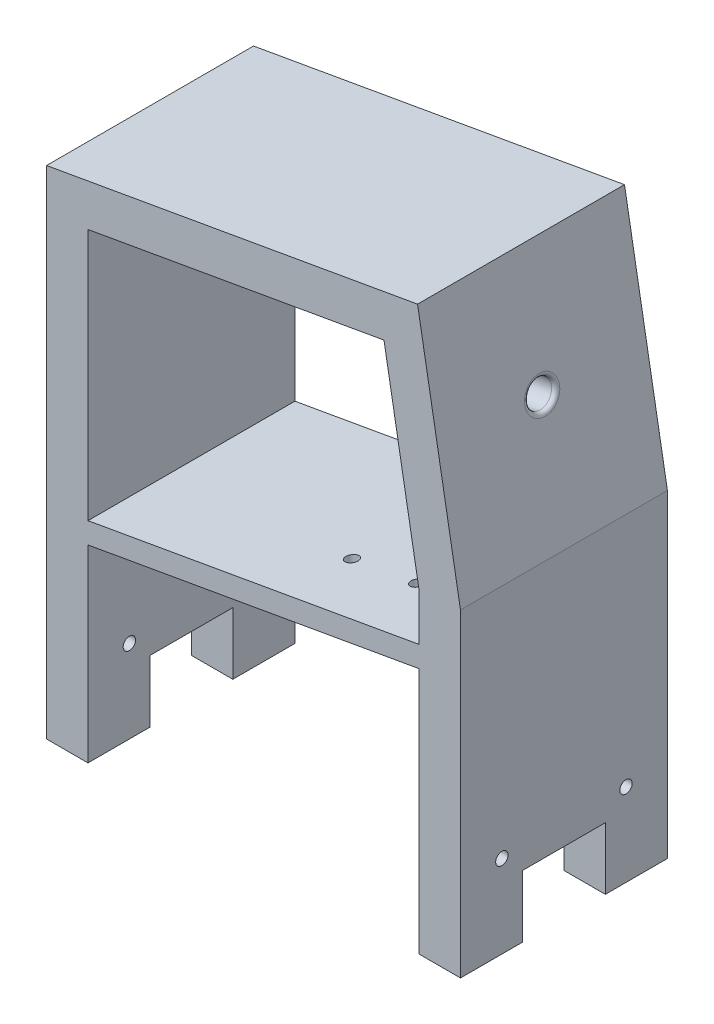
ISO-10303-21;
HEADER;
FILE_DESCRIPTION(('STEP AP214'),'2;1');
FILE_NAME('part.step','',(''),(''),'','','');
FILE_SCHEMA(('AUTOMOTIVE_DESIGN { 1 0 10303 214 1 1 1 1 }'));
ENDSEC;
DATA;
#1=APPLICATION_CONTEXT('core data for automotive mechanical design processes');
#2=APPLICATION_PROTOCOL_DEFINITION('international standard','automotive_design',2000,#1);
#3=PRODUCT_CONTEXT('',#1,'mechanical');
#4=PRODUCT('Part','Part','',(#3));
#5=PRODUCT_RELATED_PRODUCT_CATEGORY('part','',(#4));
#6=PRODUCT_DEFINITION_FORMATION('','',#4);
#7=PRODUCT_DEFINITION_CONTEXT('part definition',#1,'design');
#8=PRODUCT_DEFINITION('design','',#6,#7);
#9=PRODUCT_DEFINITION_SHAPE('','',#8);
#10=(LENGTH_UNIT() NAMED_UNIT(*) SI_UNIT(.MILLI.,.METRE.));
#11=(NAMED_UNIT(*) PLANE_ANGLE_UNIT() SI_UNIT($,.RADIAN.));
#12=(NAMED_UNIT(*) SI_UNIT($,.STERADIAN.) SOLID_ANGLE_UNIT());
#13=UNCERTAINTY_MEASURE_WITH_UNIT(LENGTH_MEASURE(1.E-05),#10,'distance_accuracy_value','');
#14=(GEOMETRIC_REPRESENTATION_CONTEXT(3) GLOBAL_UNCERTAINTY_ASSIGNED_CONTEXT((#13)) GLOBAL_UNIT_ASSIGNED_CONTEXT((#10,
#11,#12)) REPRESENTATION_CONTEXT('',''));
#15=CARTESIAN_POINT('',(0.,0.,0.));
#16=DIRECTION('',(0.,0.,1.));
#17=DIRECTION('',(1.,0.,0.));
#18=AXIS2_PLACEMENT_3D('',#15,#16,#17);
#19=CARTESIAN_POINT('',(50.0100000000001,105.,15.));
#20=DIRECTION('',(0.,1.,0.));
#21=DIRECTION('',(-1.,0.,0.));
#22=AXIS2_PLACEMENT_3D('',#19,#20,#21);
#23=PLANE('',#22);
#24=DIRECTION('',(0.,0.,-1.));
#25=VECTOR('',#24,1.);
#26=CARTESIAN_POINT('',(40.,105.,50.));
#27=LINE('',#26,#25);
#28=CARTESIAN_POINT('',(40.,105.,15.));
#29=VERTEX_POINT('',#28);
#30=CARTESIAN_POINT('',(40.,105.,0.));
#31=VERTEX_POINT('',#30);
#32=EDGE_CURVE('E393',#29,#31,#27,.T.);
#33=ORIENTED_EDGE('',*,*,#32,.T.);
#34=DIRECTION('',(-1.,0.,0.));
#35=VECTOR('',#34,1.);
#36=CARTESIAN_POINT('',(0.,105.,0.));
#37=LINE('',#36,#35);
#38=CARTESIAN_POINT('',(50.,105.,0.));
#39=VERTEX_POINT('',#38);
#40=EDGE_CURVE('E340',#39,#31,#37,.T.);
#41=ORIENTED_EDGE('',*,*,#40,.F.);
#42=DIRECTION('',(0.,0.,-1.));
#43=VECTOR('',#42,1.);
#44=CARTESIAN_POINT('',(50.,105.,50.));
#45=LINE('',#44,#43);
#46=CARTESIAN_POINT('',(50.,105.,15.));
#47=VERTEX_POINT('',#46);
#48=EDGE_CURVE('E349',#47,#39,#45,.T.);
#49=ORIENTED_EDGE('',*,*,#48,.F.);
#50=DIRECTION('',(-1.,0.,0.));
#51=VECTOR('',#50,1.);
#52=CARTESIAN_POINT('',(50.0100000000001,105.,15.));
#53=LINE('',#52,#51);
#54=EDGE_CURVE('E53',#47,#29,#53,.T.);
#55=ORIENTED_EDGE('',*,*,#54,.T.);
#56=EDGE_LOOP('',(#33,#41,#49,#55));
#57=FACE_BOUND('',#56,.T.);
#58=ADVANCED_FACE('F43',(#57),#23,.F.);
#59=CARTESIAN_POINT('',(50.0100000000001,105.,50.));
#60=DIRECTION('',(0.,1.,0.));
#61=DIRECTION('',(0.,0.,1.));
#62=AXIS2_PLACEMENT_3D('',#59,#60,#61);
#63=PLANE('',#62);
#64=DIRECTION('',(0.,0.,-1.));
#65=VECTOR('',#64,1.);
#66=CARTESIAN_POINT('',(40.,105.,49.9999999999999));
#67=LINE('',#66,#65);
#68=CARTESIAN_POINT('',(40.,105.,50.));
#69=VERTEX_POINT('',#68);
#70=CARTESIAN_POINT('',(40.,105.,35.));
#71=VERTEX_POINT('',#70);
#72=EDGE_CURVE('E402',#69,#71,#67,.T.);
#73=ORIENTED_EDGE('',*,*,#72,.T.);
#74=DIRECTION('',(-1.,0.,0.));
#75=VECTOR('',#74,1.);
#76=CARTESIAN_POINT('',(50.0100000000001,105.,35.));
#77=LINE('',#76,#75);
#78=CARTESIAN_POINT('',(50.,105.,35.));
#79=VERTEX_POINT('',#78);
#80=EDGE_CURVE('E343',#79,#71,#77,.T.);
#81=ORIENTED_EDGE('',*,*,#80,.F.);
#82=DIRECTION('',(0.,0.,-1.));
#83=VECTOR('',#82,1.);
#84=CARTESIAN_POINT('',(50.,105.,49.9999999999999));
#85=LINE('',#84,#83);
#86=CARTESIAN_POINT('',(50.,105.,50.));
#87=VERTEX_POINT('',#86);
#88=EDGE_CURVE('E357',#87,#79,#85,.T.);
#89=ORIENTED_EDGE('',*,*,#88,.F.);
#90=DIRECTION('',(-1.,0.,0.));
#91=VECTOR('',#90,1.);
#92=CARTESIAN_POINT('',(0.,105.,50.));
#93=LINE('',#92,#91);
#94=EDGE_CURVE('E69',#87,#69,#93,.T.);
#95=ORIENTED_EDGE('',*,*,#94,.T.);
#96=EDGE_LOOP('',(#73,#81,#89,#95));
#97=FACE_BOUND('',#96,.T.);
#98=ADVANCED_FACE('F457',(#97),#63,.F.);
#99=CARTESIAN_POINT('',(50.0100000000001,120.,15.));
#100=DIRECTION('',(0.,0.,-1.));
#101=DIRECTION('',(0.,1.,0.));
#102=AXIS2_PLACEMENT_3D('',#99,#100,#101);
#103=PLANE('',#102);
#104=DIRECTION('',(0.,-1.,0.));
#105=VECTOR('',#104,1.);
#106=CARTESIAN_POINT('',(40.,10.,15.));
#107=LINE('',#106,#105);
#108=CARTESIAN_POINT('',(40.,120.,15.));
#109=VERTEX_POINT('',#108);
#110=EDGE_CURVE('E397',#109,#29,#107,.T.);
#111=ORIENTED_EDGE('',*,*,#110,.T.);
#112=ORIENTED_EDGE('',*,*,#54,.F.);
#113=DIRECTION('',(0.,-1.,0.));
#114=VECTOR('',#113,1.);
#115=CARTESIAN_POINT('',(50.,0.,15.));
#116=LINE('',#115,#114);
#117=CARTESIAN_POINT('',(50.,120.,15.));
#118=VERTEX_POINT('',#117);
#119=EDGE_CURVE('E344',#118,#47,#116,.T.);
#120=ORIENTED_EDGE('',*,*,#119,.F.);
#121=DIRECTION('',(-1.,0.,0.));
#122=VECTOR('',#121,1.);
#123=CARTESIAN_POINT('',(50.0100000000001,120.,15.));
#124=LINE('',#123,#122);
#125=EDGE_CURVE('E381',#118,#109,#124,.T.);
#126=ORIENTED_EDGE('',*,*,#125,.T.);
#127=EDGE_LOOP('',(#111,#112,#120,#126));
#128=FACE_BOUND('',#127,.T.);
#129=ADVANCED_FACE('F452',(#128),#103,.F.);
#130=CARTESIAN_POINT('',(50.0100000000001,120.,35.));
#131=DIRECTION('',(0.,1.,0.));
#132=DIRECTION('',(-1.,0.,0.));
#133=AXIS2_PLACEMENT_3D('',#130,#131,#132);
#134=PLANE('',#133);
#135=DIRECTION('',(0.,0.,-1.));
#136=VECTOR('',#135,1.);
#137=CARTESIAN_POINT('',(40.,120.,50.));
#138=LINE('',#137,#136);
#139=CARTESIAN_POINT('',(40.,120.,35.));
#140=VERTEX_POINT('',#139);
#141=EDGE_CURVE('E414',#140,#109,#138,.T.);
#142=ORIENTED_EDGE('',*,*,#141,.T.);
#143=ORIENTED_EDGE('',*,*,#125,.F.);
#144=DIRECTION('',(0.,0.,-1.));
#145=VECTOR('',#144,1.);
#146=CARTESIAN_POINT('',(50.,120.,50.));
#147=LINE('',#146,#145);
#148=CARTESIAN_POINT('',(50.,120.,35.));
#149=VERTEX_POINT('',#148);
#150=EDGE_CURVE('E348',#149,#118,#147,.T.);
#151=ORIENTED_EDGE('',*,*,#150,.F.);
#152=DIRECTION('',(-1.,0.,0.));
#153=VECTOR('',#152,1.);
#154=CARTESIAN_POINT('',(50.0100000000001,120.,35.));
#155=LINE('',#154,#153);
#156=EDGE_CURVE('E386',#149,#140,#155,.T.);
#157=ORIENTED_EDGE('',*,*,#156,.T.);
#158=EDGE_LOOP('',(#142,#143,#151,#157));
#159=FACE_BOUND('',#158,.T.);
#160=ADVANCED_FACE('F440',(#159),#134,.F.);
#161=CARTESIAN_POINT('',(50.0100000000001,105.,35.));
#162=DIRECTION('',(0.,0.,1.));
#163=DIRECTION('',(1.,0.,0.));
#164=AXIS2_PLACEMENT_3D('',#161,#162,#163);
#165=PLANE('',#164);
#166=DIRECTION('',(0.,1.,0.));
#167=VECTOR('',#166,1.);
#168=CARTESIAN_POINT('',(40.,10.,35.));
#169=LINE('',#168,#167);
#170=EDGE_CURVE('E408',#71,#140,#169,.T.);
#171=ORIENTED_EDGE('',*,*,#170,.T.);
#172=ORIENTED_EDGE('',*,*,#156,.F.);
#173=DIRECTION('',(0.,1.,0.));
#174=VECTOR('',#173,1.);
#175=CARTESIAN_POINT('',(50.,0.,35.));
#176=LINE('',#175,#174);
#177=EDGE_CURVE('E353',#79,#149,#176,.T.);
#178=ORIENTED_EDGE('',*,*,#177,.F.);
#179=ORIENTED_EDGE('',*,*,#80,.T.);
#180=EDGE_LOOP('',(#171,#172,#178,#179));
#181=FACE_BOUND('',#180,.T.);
#182=ADVANCED_FACE('F430',(#181),#165,.F.);
#183=DIRECTION('',(0.,-1.,0.));
#184=VECTOR('',#183,1.);
#185=CARTESIAN_POINT('',(-40.,216.619003688227,35.));
#186=LINE('',#185,#184);
#187=CARTESIAN_POINT('',(-40.,120.,35.));
#188=VERTEX_POINT('',#187);
#189=CARTESIAN_POINT('',(-40.,105.,35.));
#190=VERTEX_POINT('',#189);
#191=EDGE_CURVE('E47',#188,#190,#186,.T.);
#192=ORIENTED_EDGE('',*,*,#191,.T.);
#193=CARTESIAN_POINT('',(-50.,105.,35.));
#194=VERTEX_POINT('',#193);
#195=EDGE_CURVE('E387',#190,#194,#77,.T.);
#196=ORIENTED_EDGE('',*,*,#195,.T.);
#197=DIRECTION('',(0.,-1.,0.));
#198=VECTOR('',#197,1.);
#199=CARTESIAN_POINT('',(-50.,225.01,35.));
#200=LINE('',#199,#198);
#201=CARTESIAN_POINT('',(-50.,120.,35.));
#202=VERTEX_POINT('',#201);
#203=EDGE_CURVE('E370',#202,#194,#200,.T.);
#204=ORIENTED_EDGE('',*,*,#203,.F.);
#205=EDGE_CURVE('E382',#188,#202,#155,.T.);
#206=ORIENTED_EDGE('',*,*,#205,.F.);
#207=EDGE_LOOP('',(#192,#196,#204,#206));
#208=FACE_BOUND('',#207,.T.);
#209=ADVANCED_FACE('F483',(#208),#165,.F.);
#210=DIRECTION('',(0.,0.,1.));
#211=VECTOR('',#210,1.);
#212=CARTESIAN_POINT('',(-40.,120.,50.));
#213=LINE('',#212,#211);
#214=CARTESIAN_POINT('',(-40.,120.,15.));
#215=VERTEX_POINT('',#214);
#216=EDGE_CURVE('E418',#215,#188,#213,.T.);
#217=ORIENTED_EDGE('',*,*,#216,.T.);
#218=ORIENTED_EDGE('',*,*,#205,.T.);
#219=DIRECTION('',(0.,0.,1.));
#220=VECTOR('',#219,1.);
#221=CARTESIAN_POINT('',(-50.,120.,50.));
#222=LINE('',#221,#220);
#223=CARTESIAN_POINT('',(-50.,120.,15.));
#224=VERTEX_POINT('',#223);
#225=EDGE_CURVE('E366',#224,#202,#222,.T.);
#226=ORIENTED_EDGE('',*,*,#225,.F.);
#227=EDGE_CURVE('E377',#215,#224,#124,.T.);
#228=ORIENTED_EDGE('',*,*,#227,.F.);
#229=EDGE_LOOP('',(#217,#218,#226,#228));
#230=FACE_BOUND('',#229,.T.);
#231=ADVANCED_FACE('F475',(#230),#134,.F.);
#232=DIRECTION('',(0.,1.,0.));
#233=VECTOR('',#232,1.);
#234=CARTESIAN_POINT('',(-40.,216.619003688227,15.));
#235=LINE('',#234,#233);
#236=CARTESIAN_POINT('',(-40.,105.,15.));
#237=VERTEX_POINT('',#236);
#238=EDGE_CURVE('E403',#237,#215,#235,.T.);
#239=ORIENTED_EDGE('',*,*,#238,.T.);
#240=ORIENTED_EDGE('',*,*,#227,.T.);
#241=DIRECTION('',(0.,1.,0.));
#242=VECTOR('',#241,1.);
#243=CARTESIAN_POINT('',(-50.,225.01,15.));
#244=LINE('',#243,#242);
#245=CARTESIAN_POINT('',(-50.,105.,15.));
#246=VERTEX_POINT('',#245);
#247=EDGE_CURVE('E362',#246,#224,#244,.T.);
#248=ORIENTED_EDGE('',*,*,#247,.F.);
#249=EDGE_CURVE('E11',#237,#246,#53,.T.);
#250=ORIENTED_EDGE('',*,*,#249,.F.);
#251=EDGE_LOOP('',(#239,#240,#248,#250));
#252=FACE_BOUND('',#251,.T.);
#253=ADVANCED_FACE('F464',(#252),#103,.F.);
#254=DIRECTION('',(0.,0.,1.));
#255=VECTOR('',#254,1.);
#256=CARTESIAN_POINT('',(-40.,105.,50.0000000000001));
#257=LINE('',#256,#255);
#258=CARTESIAN_POINT('',(-40.,105.,50.));
#259=VERTEX_POINT('',#258);
#260=EDGE_CURVE('E375',#190,#259,#257,.T.);
#261=ORIENTED_EDGE('',*,*,#260,.T.);
#262=CARTESIAN_POINT('',(-50.,105.,50.));
#263=VERTEX_POINT('',#262);
#264=EDGE_CURVE('E61',#259,#263,#93,.T.);
#265=ORIENTED_EDGE('',*,*,#264,.T.);
#266=DIRECTION('',(0.,0.,1.));
#267=VECTOR('',#266,1.);
#268=CARTESIAN_POINT('',(-50.,105.,50.0000000000001));
#269=LINE('',#268,#267);
#270=EDGE_CURVE('E373',#194,#263,#269,.T.);
#271=ORIENTED_EDGE('',*,*,#270,.F.);
#272=ORIENTED_EDGE('',*,*,#195,.F.);
#273=EDGE_LOOP('',(#261,#265,#271,#272));
#274=FACE_BOUND('',#273,.T.);
#275=ADVANCED_FACE('F45',(#274),#63,.F.);
#276=DIRECTION('',(0.,0.,1.));
#277=VECTOR('',#276,1.);
#278=CARTESIAN_POINT('',(-40.,105.,50.));
#279=LINE('',#278,#277);
#280=CARTESIAN_POINT('',(-40.,105.,0.));
#281=VERTEX_POINT('',#280);
#282=EDGE_CURVE('E398',#281,#237,#279,.T.);
#283=ORIENTED_EDGE('',*,*,#282,.T.);
#284=ORIENTED_EDGE('',*,*,#249,.T.);
#285=DIRECTION('',(0.,0.,1.));
#286=VECTOR('',#285,1.);
#287=CARTESIAN_POINT('',(-50.,105.,50.));
#288=LINE('',#287,#286);
#289=CARTESIAN_POINT('',(-50.,105.,0.));
#290=VERTEX_POINT('',#289);
#291=EDGE_CURVE('E358',#290,#246,#288,.T.);
#292=ORIENTED_EDGE('',*,*,#291,.F.);
#293=EDGE_CURVE('E337',#281,#290,#37,.T.);
#294=ORIENTED_EDGE('',*,*,#293,.F.);
#295=EDGE_LOOP('',(#283,#284,#292,#294));
#296=FACE_BOUND('',#295,.T.);
#297=ADVANCED_FACE('F466',(#296),#23,.F.);
#298=CARTESIAN_POINT('',(34.8854248320588,210.141310529754,25.));
#299=DIRECTION('',(0.984807753012208,0.173648177666931,0.));
#300=DIRECTION('',(-0.173648177666931,0.984807753012208,0.));
#301=AXIS2_PLACEMENT_3D('',#298,#299,#300);
#302=CYLINDRICAL_SURFACE('',#301,3.20000000000001);
#303=CARTESIAN_POINT('',(43.7486946091687,211.704144128756,25.));
#304=DIRECTION('',(-0.984807753012208,-0.173648177666931,0.));
#305=DIRECTION('',(0.173648177666931,-0.984807753012208,0.));
#306=AXIS2_PLACEMENT_3D('',#303,#304,#305);
#307=CIRCLE('',#306,3.20000000000001);
#308=CARTESIAN_POINT('',(44.3043687777029,208.552759319117,25.));
#309=VERTEX_POINT('',#308);
#310=EDGE_CURVE('E329',#309,#309,#307,.F.);
#311=ORIENTED_EDGE('',*,*,#310,.T.);
#312=EDGE_LOOP('',(#311));
#313=FACE_BOUND('',#312,.T.);
#314=CARTESIAN_POINT('',(34.8854248320588,210.141310529754,25.));
#315=DIRECTION('',(0.984807753012208,0.173648177666931,0.));
#316=DIRECTION('',(-0.173648177666931,0.984807753012208,0.));
#317=AXIS2_PLACEMENT_3D('',#314,#315,#316);
#318=CIRCLE('',#317,3.20000000000001);
#319=CARTESIAN_POINT('',(34.3297506635247,213.292695339393,25.));
#320=VERTEX_POINT('',#319);
#321=EDGE_CURVE('E243',#320,#320,#318,.T.);
#322=ORIENTED_EDGE('',*,*,#321,.F.);
#323=EDGE_LOOP('',(#322));
#324=FACE_BOUND('',#323,.T.);
#325=ADVANCED_FACE('F473',(#313,#324),#302,.F.);
#326=CARTESIAN_POINT('',(43.7486946091687,211.704144128756,25.));
#327=DIRECTION('',(-0.984807753012208,-0.173648177666931,0.));
#328=DIRECTION('',(0.173648177666931,-0.984807753012208,0.));
#329=AXIS2_PLACEMENT_3D('',#326,#327,#328);
#330=TOROIDAL_SURFACE('',#329,4.20000000000001,1.);
#331=ORIENTED_EDGE('',*,*,#310,.F.);
#332=EDGE_LOOP('',(#331));
#333=FACE_BOUND('',#332,.T.);
#334=CARTESIAN_POINT('',(44.7335023621809,211.877792306423,25.));
#335=DIRECTION('',(-0.984807753012208,-0.173648177666931,0.));
#336=DIRECTION('',(0.173648177666931,-0.984807753012208,0.));
#337=AXIS2_PLACEMENT_3D('',#334,#335,#336);
#338=CIRCLE('',#337,4.20000000000001);
#339=CARTESIAN_POINT('',(45.4628247083821,207.741599743772,25.));
#340=VERTEX_POINT('',#339);
#341=EDGE_CURVE('E333',#340,#340,#338,.T.);
#342=ORIENTED_EDGE('',*,*,#341,.F.);
#343=EDGE_LOOP('',(#342));
#344=FACE_BOUND('',#343,.T.);
#345=ADVANCED_FACE('F624',(#333,#344),#330,.T.);
#346=CARTESIAN_POINT('',(9.27637798527169,251.267599597638,15.4));
#347=DIRECTION('',(0.173648177666932,-0.984807753012208,0.));
#348=DIRECTION('',(0.984807753012208,0.173648177666932,0.));
#349=AXIS2_PLACEMENT_3D('',#346,#347,#348);
#350=CYLINDRICAL_SURFACE('',#349,1.485);
#351=CARTESIAN_POINT('',(24.1346629080452,167.002078444413,15.4));
#352=DIRECTION('',(-0.173648177666932,0.984807753012208,0.));
#353=DIRECTION('',(-0.984807753012208,-0.173648177666932,0.));
#354=AXIS2_PLACEMENT_3D('',#351,#352,#353);
#355=CIRCLE('',#354,1.485);
#356=CARTESIAN_POINT('',(22.672223394822,166.744210900578,15.4));
#357=VERTEX_POINT('',#356);
#358=EDGE_CURVE('E507',#357,#357,#355,.T.);
#359=ORIENTED_EDGE('',*,*,#358,.T.);
#360=EDGE_LOOP('',(#359));
#361=FACE_BOUND('',#360,.T.);
#362=CARTESIAN_POINT('',(25.0029037963798,162.078039679352,15.4));
#363=DIRECTION('',(-0.173648177666932,0.984807753012208,0.));
#364=DIRECTION('',(-0.984807753012208,-0.173648177666932,0.));
#365=AXIS2_PLACEMENT_3D('',#362,#363,#364);
#366=CIRCLE('',#365,1.485);
#367=CARTESIAN_POINT('',(23.5404642831567,161.820172135517,15.4));
#368=VERTEX_POINT('',#367);
#369=EDGE_CURVE('E500',#368,#368,#366,.T.);
#370=ORIENTED_EDGE('',*,*,#369,.F.);
#371=EDGE_LOOP('',(#370));
#372=FACE_BOUND('',#371,.T.);
#373=ADVANCED_FACE('F626',(#361,#372),#350,.F.);
#374=CARTESIAN_POINT('',(9.27637798527169,251.267599597638,34.6));
#375=DIRECTION('',(0.173648177666932,-0.984807753012208,0.));
#376=DIRECTION('',(0.984807753012208,0.173648177666932,0.));
#377=AXIS2_PLACEMENT_3D('',#374,#375,#376);
#378=CYLINDRICAL_SURFACE('',#377,1.48500000000002);
#379=CARTESIAN_POINT('',(24.1346629080452,167.002078444413,34.6));
#380=DIRECTION('',(-0.173648177666932,0.984807753012208,0.));
#381=DIRECTION('',(-0.984807753012208,-0.173648177666932,0.));
#382=AXIS2_PLACEMENT_3D('',#379,#380,#381);
#383=CIRCLE('',#382,1.48500000000002);
#384=CARTESIAN_POINT('',(22.672223394822,166.744210900578,34.6));
#385=VERTEX_POINT('',#384);
#386=EDGE_CURVE('E526',#385,#385,#383,.T.);
#387=ORIENTED_EDGE('',*,*,#386,.T.);
#388=EDGE_LOOP('',(#387));
#389=FACE_BOUND('',#388,.T.);
#390=CARTESIAN_POINT('',(25.0029037963798,162.078039679352,34.6));
#391=DIRECTION('',(-0.173648177666932,0.984807753012208,0.));
#392=DIRECTION('',(-0.984807753012208,-0.173648177666932,0.));
#393=AXIS2_PLACEMENT_3D('',#390,#391,#392);
#394=CIRCLE('',#393,1.48500000000002);
#395=CARTESIAN_POINT('',(23.5404642831567,161.820172135517,34.6));
#396=VERTEX_POINT('',#395);
#397=EDGE_CURVE('E511',#396,#396,#394,.T.);
#398=ORIENTED_EDGE('',*,*,#397,.F.);
#399=EDGE_LOOP('',(#398));
#400=FACE_BOUND('',#399,.T.);
#401=ADVANCED_FACE('F682',(#389,#400),#378,.F.);
#402=CARTESIAN_POINT('',(-6.48054606292366,248.489228754967,34.6));
#403=DIRECTION('',(0.173648177666932,-0.984807753012208,0.));
#404=DIRECTION('',(0.984807753012208,0.173648177666932,0.));
#405=AXIS2_PLACEMENT_3D('',#402,#403,#404);
#406=CYLINDRICAL_SURFACE('',#405,1.48500000000001);
#407=CARTESIAN_POINT('',(8.37773885984984,164.223707601742,34.6));
#408=DIRECTION('',(-0.173648177666932,0.984807753012208,0.));
#409=DIRECTION('',(-0.984807753012208,-0.173648177666932,0.));
#410=AXIS2_PLACEMENT_3D('',#407,#408,#409);
#411=CIRCLE('',#410,1.48500000000001);
#412=CARTESIAN_POINT('',(6.91529934662671,163.965840057907,34.6));
#413=VERTEX_POINT('',#412);
#414=EDGE_CURVE('E516',#413,#413,#411,.T.);
#415=ORIENTED_EDGE('',*,*,#414,.T.);
#416=EDGE_LOOP('',(#415));
#417=FACE_BOUND('',#416,.T.);
#418=CARTESIAN_POINT('',(9.24597974818449,159.299668836681,34.6));
#419=DIRECTION('',(-0.173648177666932,0.984807753012208,0.));
#420=DIRECTION('',(0.984807753012208,0.173648177666932,0.));
#421=AXIS2_PLACEMENT_3D('',#418,#419,#420);
#422=CIRCLE('',#421,1.48500000000001);
#423=CARTESIAN_POINT('',(10.7084192614076,159.557536380517,34.6));
#424=VERTEX_POINT('',#423);
#425=EDGE_CURVE('E522',#424,#424,#422,.T.);
#426=ORIENTED_EDGE('',*,*,#425,.F.);
#427=EDGE_LOOP('',(#426));
#428=FACE_BOUND('',#427,.T.);
#429=ADVANCED_FACE('F673',(#417,#428),#406,.F.);
#430=CARTESIAN_POINT('',(-6.48054606292366,248.489228754967,15.4));
#431=DIRECTION('',(0.173648177666932,-0.984807753012208,0.));
#432=DIRECTION('',(0.984807753012208,0.173648177666932,0.));
#433=AXIS2_PLACEMENT_3D('',#430,#431,#432);
#434=CYLINDRICAL_SURFACE('',#433,1.48499999999999);
#435=CARTESIAN_POINT('',(8.37773885984984,164.223707601742,15.4));
#436=DIRECTION('',(-0.173648177666932,0.984807753012208,0.));
#437=DIRECTION('',(-0.984807753012208,-0.173648177666932,0.));
#438=AXIS2_PLACEMENT_3D('',#435,#436,#437);
#439=CIRCLE('',#438,1.48499999999999);
#440=CARTESIAN_POINT('',(6.91529934662672,163.965840057907,15.4));
#441=VERTEX_POINT('',#440);
#442=EDGE_CURVE('E517',#441,#441,#439,.T.);
#443=ORIENTED_EDGE('',*,*,#442,.T.);
#444=EDGE_LOOP('',(#443));
#445=FACE_BOUND('',#444,.T.);
#446=CARTESIAN_POINT('',(9.24597974818449,159.299668836681,15.4));
#447=DIRECTION('',(-0.173648177666932,0.984807753012208,0.));
#448=DIRECTION('',(0.984807753012208,0.173648177666932,0.));
#449=AXIS2_PLACEMENT_3D('',#446,#447,#448);
#450=CIRCLE('',#449,1.48499999999999);
#451=CARTESIAN_POINT('',(10.7084192614076,159.557536380517,15.4));
#452=VERTEX_POINT('',#451);
#453=EDGE_CURVE('E512',#452,#452,#450,.T.);
#454=ORIENTED_EDGE('',*,*,#453,.F.);
#455=EDGE_LOOP('',(#454));
#456=FACE_BOUND('',#455,.T.);
#457=ADVANCED_FACE('F585',(#445,#456),#434,.F.);
#458=CARTESIAN_POINT('',(-40.,204.163858421681,25.));
#459=DIRECTION('',(-1.,0.,0.));
#460=DIRECTION('',(0.,-1.,0.));
#461=AXIS2_PLACEMENT_3D('',#458,#459,#460);
#462=CYLINDRICAL_SURFACE('',#461,5.);
#463=CARTESIAN_POINT('',(-40.,204.163858421681,25.));
#464=DIRECTION('',(-1.,0.,0.));
#465=DIRECTION('',(0.,-1.,0.));
#466=AXIS2_PLACEMENT_3D('',#463,#464,#465);
#467=CIRCLE('',#466,5.);
#468=CARTESIAN_POINT('',(-40.,199.163858421681,25.));
#469=VERTEX_POINT('',#468);
#470=EDGE_CURVE('E235',#469,#469,#467,.T.);
#471=ORIENTED_EDGE('',*,*,#470,.F.);
#472=EDGE_LOOP('',(#471));
#473=FACE_BOUND('',#472,.T.);
#474=CARTESIAN_POINT('',(-50.,204.163858421681,25.));
#475=DIRECTION('',(-1.,0.,0.));
#476=DIRECTION('',(0.,-1.,0.));
#477=AXIS2_PLACEMENT_3D('',#474,#475,#476);
#478=CIRCLE('',#477,5.);
#479=CARTESIAN_POINT('',(-50.,199.163858421681,25.));
#480=VERTEX_POINT('',#479);
#481=EDGE_CURVE('E496',#480,#480,#478,.T.);
#482=ORIENTED_EDGE('',*,*,#481,.T.);
#483=EDGE_LOOP('',(#482));
#484=FACE_BOUND('',#483,.T.);
#485=ADVANCED_FACE('F574',(#473,#484),#462,.F.);
#486=CARTESIAN_POINT('',(50.,125.,10.));
#487=DIRECTION('',(-1.,0.,0.));
#488=DIRECTION('',(0.,-1.,0.));
#489=AXIS2_PLACEMENT_3D('',#486,#487,#488);
#490=CYLINDRICAL_SURFACE('',#489,1.5);
#491=CARTESIAN_POINT('',(-40.,125.,10.));
#492=DIRECTION('',(1.,0.,0.));
#493=DIRECTION('',(0.,1.,0.));
#494=AXIS2_PLACEMENT_3D('',#491,#492,#493);
#495=CIRCLE('',#494,1.5);
#496=CARTESIAN_POINT('',(-40.,126.5,10.));
#497=VERTEX_POINT('',#496);
#498=EDGE_CURVE('E543',#497,#497,#495,.F.);
#499=ORIENTED_EDGE('',*,*,#498,.F.);
#500=EDGE_LOOP('',(#499));
#501=FACE_BOUND('',#500,.T.);
#502=CARTESIAN_POINT('',(-50.,125.,10.));
#503=DIRECTION('',(1.,0.,0.));
#504=DIRECTION('',(0.,1.,0.));
#505=AXIS2_PLACEMENT_3D('',#502,#503,#504);
#506=CIRCLE('',#505,1.5);
#507=CARTESIAN_POINT('',(-50.,126.5,10.));
#508=VERTEX_POINT('',#507);
#509=EDGE_CURVE('E551',#508,#508,#506,.T.);
#510=ORIENTED_EDGE('',*,*,#509,.F.);
#511=EDGE_LOOP('',(#510));
#512=FACE_BOUND('',#511,.T.);
#513=ADVANCED_FACE('F571',(#501,#512),#490,.F.);
#514=CARTESIAN_POINT('',(50.,125.,40.));
#515=DIRECTION('',(-1.,0.,0.));
#516=DIRECTION('',(0.,-1.,0.));
#517=AXIS2_PLACEMENT_3D('',#514,#515,#516);
#518=CYLINDRICAL_SURFACE('',#517,1.5);
#519=CARTESIAN_POINT('',(-40.,125.,40.));
#520=DIRECTION('',(1.,0.,0.));
#521=DIRECTION('',(0.,1.,0.));
#522=AXIS2_PLACEMENT_3D('',#519,#520,#521);
#523=CIRCLE('',#522,1.5);
#524=CARTESIAN_POINT('',(-40.,126.5,40.));
#525=VERTEX_POINT('',#524);
#526=EDGE_CURVE('E521',#525,#525,#523,.T.);
#527=ORIENTED_EDGE('',*,*,#526,.T.);
#528=EDGE_LOOP('',(#527));
#529=FACE_BOUND('',#528,.T.);
#530=CARTESIAN_POINT('',(-50.,125.,40.));
#531=DIRECTION('',(-1.,0.,0.));
#532=DIRECTION('',(0.,-1.,0.));
#533=AXIS2_PLACEMENT_3D('',#530,#531,#532);
#534=CIRCLE('',#533,1.5);
#535=CARTESIAN_POINT('',(-50.,123.5,40.));
#536=VERTEX_POINT('',#535);
#537=EDGE_CURVE('E556',#536,#536,#534,.T.);
#538=ORIENTED_EDGE('',*,*,#537,.T.);
#539=EDGE_LOOP('',(#538));
#540=FACE_BOUND('',#539,.T.);
#541=ADVANCED_FACE('F573',(#529,#540),#518,.F.);
#542=CARTESIAN_POINT('',(40.,125.,10.));
#543=DIRECTION('',(-1.,0.,0.));
#544=DIRECTION('',(0.,0.,1.));
#545=AXIS2_PLACEMENT_3D('',#542,#543,#544);
#546=CIRCLE('',#545,1.5);
#547=CARTESIAN_POINT('',(40.,125.,11.5));
#548=VERTEX_POINT('',#547);
#549=EDGE_CURVE('E547',#548,#548,#546,.F.);
#550=ORIENTED_EDGE('',*,*,#549,.F.);
#551=EDGE_LOOP('',(#550));
#552=FACE_BOUND('',#551,.T.);
#553=CARTESIAN_POINT('',(50.,125.,10.));
#554=DIRECTION('',(1.,0.,0.));
#555=DIRECTION('',(0.,1.,0.));
#556=AXIS2_PLACEMENT_3D('',#553,#554,#555);
#557=CIRCLE('',#556,1.5);
#558=CARTESIAN_POINT('',(50.,126.5,10.));
#559=VERTEX_POINT('',#558);
#560=EDGE_CURVE('E560',#559,#559,#557,.T.);
#561=ORIENTED_EDGE('',*,*,#560,.T.);
#562=EDGE_LOOP('',(#561));
#563=FACE_BOUND('',#562,.T.);
#564=ADVANCED_FACE('F577',(#552,#563),#490,.F.);
#565=CARTESIAN_POINT('',(40.,125.,40.));
#566=DIRECTION('',(-1.,0.,0.));
#567=DIRECTION('',(0.,0.,1.));
#568=AXIS2_PLACEMENT_3D('',#565,#566,#567);
#569=CIRCLE('',#568,1.5);
#570=CARTESIAN_POINT('',(40.,125.,41.5));
#571=VERTEX_POINT('',#570);
#572=EDGE_CURVE('E539',#571,#571,#569,.T.);
#573=ORIENTED_EDGE('',*,*,#572,.T.);
#574=EDGE_LOOP('',(#573));
#575=FACE_BOUND('',#574,.T.);
#576=CARTESIAN_POINT('',(50.,125.,40.));
#577=DIRECTION('',(-1.,0.,0.));
#578=DIRECTION('',(0.,-1.,0.));
#579=AXIS2_PLACEMENT_3D('',#576,#577,#578);
#580=CIRCLE('',#579,1.5);
#581=CARTESIAN_POINT('',(50.,123.5,40.));
#582=VERTEX_POINT('',#581);
#583=EDGE_CURVE('E552',#582,#582,#580,.T.);
#584=ORIENTED_EDGE('',*,*,#583,.F.);
#585=EDGE_LOOP('',(#584));
#586=FACE_BOUND('',#585,.T.);
#587=ADVANCED_FACE('F584',(#575,#586),#518,.F.);
#588=CARTESIAN_POINT('',(40.,181.135113364741,50.));
#589=DIRECTION('',(-0.984807753012208,-0.173648177666931,0.));
#590=DIRECTION('',(0.173648177666931,-0.984807753012208,0.));
#591=AXIS2_PLACEMENT_3D('',#588,#589,#590);
#592=PLANE('',#591);
#593=ORIENTED_EDGE('',*,*,#321,.T.);
#594=EDGE_LOOP('',(#593));
#595=FACE_BOUND('',#594,.T.);
#596=DIRECTION('',(-0.173648177666931,0.984807753012208,0.));
#597=VECTOR('',#596,1.);
#598=CARTESIAN_POINT('',(40.,181.135113364741,0.));
#599=LINE('',#598,#597);
#600=CARTESIAN_POINT('',(40.,181.135113364741,0.));
#601=VERTEX_POINT('',#600);
#602=CARTESIAN_POINT('',(31.5196022043407,229.229839206389,0.));
#603=VERTEX_POINT('',#602);
#604=EDGE_CURVE('E254',#601,#603,#599,.T.);
#605=ORIENTED_EDGE('',*,*,#604,.F.);
#606=DIRECTION('',(0.,0.,-1.));
#607=VECTOR('',#606,1.);
#608=CARTESIAN_POINT('',(40.,181.135113364741,50.));
#609=LINE('',#608,#607);
#610=CARTESIAN_POINT('',(40.,181.135113364741,50.));
#611=VERTEX_POINT('',#610);
#612=EDGE_CURVE('E282',#611,#601,#609,.T.);
#613=ORIENTED_EDGE('',*,*,#612,.F.);
#614=DIRECTION('',(-0.173648177666931,0.984807753012208,0.));
#615=VECTOR('',#614,1.);
#616=CARTESIAN_POINT('',(40.,181.135113364741,50.));
#617=LINE('',#616,#615);
#618=CARTESIAN_POINT('',(31.5196022043407,229.229839206389,50.));
#619=VERTEX_POINT('',#618);
#620=EDGE_CURVE('E261',#611,#619,#617,.T.);
#621=ORIENTED_EDGE('',*,*,#620,.T.);
#622=DIRECTION('',(0.,0.,-1.));
#623=VECTOR('',#622,1.);
#624=CARTESIAN_POINT('',(31.5196022043407,229.229839206389,50.));
#625=LINE('',#624,#623);
#626=EDGE_CURVE('E264',#619,#603,#625,.T.);
#627=ORIENTED_EDGE('',*,*,#626,.T.);
#628=EDGE_LOOP('',(#605,#613,#621,#627));
#629=FACE_BOUND('',#628,.T.);
#630=ADVANCED_FACE('F594',(#595,#629),#592,.T.);
#631=CARTESIAN_POINT('',(40.,10.,50.));
#632=DIRECTION('',(-1.,0.,0.));
#633=DIRECTION('',(0.,0.,1.));
#634=AXIS2_PLACEMENT_3D('',#631,#632,#633);
#635=PLANE('',#634);
#636=DIRECTION('',(0.,0.,1.));
#637=VECTOR('',#636,1.);
#638=CARTESIAN_POINT('',(40.,169.79956543176,0.));
#639=LINE('',#638,#637);
#640=CARTESIAN_POINT('',(40.,169.79956543176,0.));
#641=VERTEX_POINT('',#640);
#642=CARTESIAN_POINT('',(40.,169.79956543176,50.));
#643=VERTEX_POINT('',#642);
#644=EDGE_CURVE('E239',#641,#643,#639,.T.);
#645=ORIENTED_EDGE('',*,*,#644,.T.);
#646=DIRECTION('',(0.,1.,0.));
#647=VECTOR('',#646,1.);
#648=CARTESIAN_POINT('',(40.,10.,50.));
#649=LINE('',#648,#647);
#650=EDGE_CURVE('E257',#643,#611,#649,.T.);
#651=ORIENTED_EDGE('',*,*,#650,.T.);
#652=ORIENTED_EDGE('',*,*,#612,.T.);
#653=DIRECTION('',(0.,1.,0.));
#654=VECTOR('',#653,1.);
#655=CARTESIAN_POINT('',(40.,10.,0.));
#656=LINE('',#655,#654);
#657=EDGE_CURVE('E272',#641,#601,#656,.T.);
#658=ORIENTED_EDGE('',*,*,#657,.F.);
#659=EDGE_LOOP('',(#645,#651,#652,#658));
#660=FACE_BOUND('',#659,.T.);
#661=ADVANCED_FACE('F609',(#660),#635,.T.);
#662=CARTESIAN_POINT('',(40.,169.79956543176,0.));
#663=DIRECTION('',(-0.173648177666932,0.984807753012208,0.));
#664=DIRECTION('',(-0.984807753012208,-0.173648177666932,0.));
#665=AXIS2_PLACEMENT_3D('',#662,#663,#664);
#666=PLANE('',#665);
#667=ORIENTED_EDGE('',*,*,#442,.F.);
#668=EDGE_LOOP('',(#667));
#669=FACE_BOUND('',#668,.T.);
#670=ORIENTED_EDGE('',*,*,#414,.F.);
#671=EDGE_LOOP('',(#670));
#672=FACE_BOUND('',#671,.T.);
#673=ORIENTED_EDGE('',*,*,#386,.F.);
#674=EDGE_LOOP('',(#673));
#675=FACE_BOUND('',#674,.T.);
#676=ORIENTED_EDGE('',*,*,#358,.F.);
#677=EDGE_LOOP('',(#676));
#678=FACE_BOUND('',#677,.T.);
#679=DIRECTION('',(-0.984807753012208,-0.173648177666932,0.));
#680=VECTOR('',#679,1.);
#681=CARTESIAN_POINT('',(40.,169.79956543176,50.));
#682=LINE('',#681,#680);
#683=CARTESIAN_POINT('',(-40.,155.693406975082,50.));
#684=VERTEX_POINT('',#683);
#685=EDGE_CURVE('E227',#643,#684,#682,.T.);
#686=ORIENTED_EDGE('',*,*,#685,.F.);
#687=ORIENTED_EDGE('',*,*,#644,.F.);
#688=DIRECTION('',(-0.984807753012208,-0.173648177666932,0.));
#689=VECTOR('',#688,1.);
#690=CARTESIAN_POINT('',(40.,169.79956543176,0.));
#691=LINE('',#690,#689);
#692=CARTESIAN_POINT('',(-40.,155.693406975082,0.));
#693=VERTEX_POINT('',#692);
#694=EDGE_CURVE('E226',#641,#693,#691,.T.);
#695=ORIENTED_EDGE('',*,*,#694,.T.);
#696=DIRECTION('',(0.,0.,1.));
#697=VECTOR('',#696,1.);
#698=CARTESIAN_POINT('',(-40.,155.693406975082,0.));
#699=LINE('',#698,#697);
#700=EDGE_CURVE('E220',#693,#684,#699,.T.);
#701=ORIENTED_EDGE('',*,*,#700,.T.);
#702=EDGE_LOOP('',(#686,#687,#695,#701));
#703=FACE_BOUND('',#702,.T.);
#704=ADVANCED_FACE('F710',(#669,#672,#675,#678,#703),#666,.T.);
#705=CARTESIAN_POINT('',(-40.,216.619003688227,50.));
#706=DIRECTION('',(1.,0.,0.));
#707=DIRECTION('',(0.,1.,0.));
#708=AXIS2_PLACEMENT_3D('',#705,#706,#707);
#709=PLANE('',#708);
#710=ORIENTED_EDGE('',*,*,#470,.T.);
#711=EDGE_LOOP('',(#710));
#712=FACE_BOUND('',#711,.T.);
#713=ORIENTED_EDGE('',*,*,#700,.F.);
#714=DIRECTION('',(0.,-1.,0.));
#715=VECTOR('',#714,1.);
#716=CARTESIAN_POINT('',(-40.,216.619003688227,0.));
#717=LINE('',#716,#715);
#718=CARTESIAN_POINT('',(-40.,216.619003688227,0.));
#719=VERTEX_POINT('',#718);
#720=EDGE_CURVE('E268',#719,#693,#717,.T.);
#721=ORIENTED_EDGE('',*,*,#720,.F.);
#722=DIRECTION('',(0.,0.,-1.));
#723=VECTOR('',#722,1.);
#724=CARTESIAN_POINT('',(-40.,216.619003688227,50.));
#725=LINE('',#724,#723);
#726=CARTESIAN_POINT('',(-40.,216.619003688227,50.));
#727=VERTEX_POINT('',#726);
#728=EDGE_CURVE('E286',#727,#719,#725,.T.);
#729=ORIENTED_EDGE('',*,*,#728,.F.);
#730=DIRECTION('',(0.,-1.,0.));
#731=VECTOR('',#730,1.);
#732=CARTESIAN_POINT('',(-40.,216.619003688227,50.));
#733=LINE('',#732,#731);
#734=EDGE_CURVE('E205',#727,#684,#733,.T.);
#735=ORIENTED_EDGE('',*,*,#734,.T.);
#736=EDGE_LOOP('',(#713,#721,#729,#735));
#737=FACE_BOUND('',#736,.T.);
#738=ADVANCED_FACE('F700',(#712,#737),#709,.T.);
#739=CARTESIAN_POINT('',(31.5196022043407,229.229839206389,50.));
#740=DIRECTION('',(0.173648177666932,-0.984807753012208,0.));
#741=DIRECTION('',(0.984807753012208,0.173648177666932,0.));
#742=AXIS2_PLACEMENT_3D('',#739,#740,#741);
#743=PLANE('',#742);
#744=DIRECTION('',(-0.984807753012208,-0.173648177666932,0.));
#745=VECTOR('',#744,1.);
#746=CARTESIAN_POINT('',(31.5196022043407,229.229839206389,0.));
#747=LINE('',#746,#745);
#748=EDGE_CURVE('E252',#603,#719,#747,.T.);
#749=ORIENTED_EDGE('',*,*,#748,.F.);
#750=ORIENTED_EDGE('',*,*,#626,.F.);
#751=DIRECTION('',(-0.984807753012208,-0.173648177666932,0.));
#752=VECTOR('',#751,1.);
#753=CARTESIAN_POINT('',(31.5196022043407,229.229839206389,50.));
#754=LINE('',#753,#752);
#755=EDGE_CURVE('E206',#619,#727,#754,.T.);
#756=ORIENTED_EDGE('',*,*,#755,.T.);
#757=ORIENTED_EDGE('',*,*,#728,.T.);
#758=EDGE_LOOP('',(#749,#750,#756,#757));
#759=FACE_BOUND('',#758,.T.);
#760=ADVANCED_FACE('F622',(#759),#743,.T.);
#761=CARTESIAN_POINT('',(50.,182.01,50.));
#762=DIRECTION('',(-0.984807753012208,-0.173648177666931,0.));
#763=DIRECTION('',(0.173648177666931,-0.984807753012208,0.));
#764=AXIS2_PLACEMENT_3D('',#761,#762,#763);
#765=PLANE('',#764);
#766=ORIENTED_EDGE('',*,*,#341,.T.);
#767=EDGE_LOOP('',(#766));
#768=FACE_BOUND('',#767,.T.);
#769=DIRECTION('',(-0.173648177666931,0.984807753012208,0.));
#770=VECTOR('',#769,1.);
#771=CARTESIAN_POINT('',(50.,182.01,0.));
#772=LINE('',#771,#770);
#773=CARTESIAN_POINT('',(50.,182.01,0.));
#774=VERTEX_POINT('',#773);
#775=CARTESIAN_POINT('',(39.6311979577935,240.814398513181,0.));
#776=VERTEX_POINT('',#775);
#777=EDGE_CURVE('E290',#774,#776,#772,.T.);
#778=ORIENTED_EDGE('',*,*,#777,.T.);
#779=DIRECTION('',(0.,0.,-1.));
#780=VECTOR('',#779,1.);
#781=CARTESIAN_POINT('',(39.6311979577935,240.814398513181,50.));
#782=LINE('',#781,#780);
#783=CARTESIAN_POINT('',(39.6311979577935,240.814398513181,50.));
#784=VERTEX_POINT('',#783);
#785=EDGE_CURVE('E325',#784,#776,#782,.T.);
#786=ORIENTED_EDGE('',*,*,#785,.F.);
#787=DIRECTION('',(-0.173648177666931,0.984807753012208,0.));
#788=VECTOR('',#787,1.);
#789=CARTESIAN_POINT('',(50.,182.01,50.));
#790=LINE('',#789,#788);
#791=CARTESIAN_POINT('',(50.,182.01,50.));
#792=VERTEX_POINT('',#791);
#793=EDGE_CURVE('E291',#792,#784,#790,.T.);
#794=ORIENTED_EDGE('',*,*,#793,.F.);
#795=DIRECTION('',(0.,0.,-1.));
#796=VECTOR('',#795,1.);
#797=CARTESIAN_POINT('',(50.,182.01,50.));
#798=LINE('',#797,#796);
#799=EDGE_CURVE('E305',#792,#774,#798,.T.);
#800=ORIENTED_EDGE('',*,*,#799,.T.);
#801=EDGE_LOOP('',(#778,#786,#794,#800));
#802=FACE_BOUND('',#801,.T.);
#803=ADVANCED_FACE('F618',(#768,#802),#765,.F.);
#804=CARTESIAN_POINT('',(39.6311979577935,240.814398513181,50.));
#805=DIRECTION('',(0.173648177666932,-0.984807753012208,0.));
#806=DIRECTION('',(0.984807753012208,0.173648177666932,0.));
#807=AXIS2_PLACEMENT_3D('',#804,#805,#806);
#808=PLANE('',#807);
#809=DIRECTION('',(-0.984807753012208,-0.173648177666932,0.));
#810=VECTOR('',#809,1.);
#811=CARTESIAN_POINT('',(39.6311979577935,240.814398513181,0.));
#812=LINE('',#811,#810);
#813=CARTESIAN_POINT('',(-50.,225.01,0.));
#814=VERTEX_POINT('',#813);
#815=EDGE_CURVE('E309',#776,#814,#812,.T.);
#816=ORIENTED_EDGE('',*,*,#815,.T.);
#817=DIRECTION('',(0.,0.,-1.));
#818=VECTOR('',#817,1.);
#819=CARTESIAN_POINT('',(-50.,225.01,50.));
#820=LINE('',#819,#818);
#821=CARTESIAN_POINT('',(-50.,225.01,50.));
#822=VERTEX_POINT('',#821);
#823=EDGE_CURVE('E321',#822,#814,#820,.T.);
#824=ORIENTED_EDGE('',*,*,#823,.F.);
#825=DIRECTION('',(-0.984807753012208,-0.173648177666932,0.));
#826=VECTOR('',#825,1.);
#827=CARTESIAN_POINT('',(39.6311979577935,240.814398513181,50.));
#828=LINE('',#827,#826);
#829=EDGE_CURVE('E295',#784,#822,#828,.T.);
#830=ORIENTED_EDGE('',*,*,#829,.F.);
#831=ORIENTED_EDGE('',*,*,#785,.T.);
#832=EDGE_LOOP('',(#816,#824,#830,#831));
#833=FACE_BOUND('',#832,.T.);
#834=ADVANCED_FACE('F614',(#833),#808,.F.);
#835=CARTESIAN_POINT('',(-50.,225.01,50.));
#836=DIRECTION('',(1.,0.,0.));
#837=DIRECTION('',(0.,1.,0.));
#838=AXIS2_PLACEMENT_3D('',#835,#836,#837);
#839=PLANE('',#838);
#840=ORIENTED_EDGE('',*,*,#537,.F.);
#841=EDGE_LOOP('',(#840));
#842=FACE_BOUND('',#841,.T.);
#843=ORIENTED_EDGE('',*,*,#509,.T.);
#844=EDGE_LOOP('',(#843));
#845=FACE_BOUND('',#844,.T.);
#846=ORIENTED_EDGE('',*,*,#481,.F.);
#847=EDGE_LOOP('',(#846));
#848=FACE_BOUND('',#847,.T.);
#849=ORIENTED_EDGE('',*,*,#203,.T.);
#850=ORIENTED_EDGE('',*,*,#270,.T.);
#851=DIRECTION('',(0.,-1.,0.));
#852=VECTOR('',#851,1.);
#853=CARTESIAN_POINT('',(-50.,225.01,50.));
#854=LINE('',#853,#852);
#855=EDGE_CURVE('E299',#822,#263,#854,.T.);
#856=ORIENTED_EDGE('',*,*,#855,.F.);
#857=ORIENTED_EDGE('',*,*,#823,.T.);
#858=DIRECTION('',(0.,-1.,0.));
#859=VECTOR('',#858,1.);
#860=CARTESIAN_POINT('',(-50.,225.01,0.));
#861=LINE('',#860,#859);
#862=EDGE_CURVE('E312',#814,#290,#861,.T.);
#863=ORIENTED_EDGE('',*,*,#862,.T.);
#864=ORIENTED_EDGE('',*,*,#291,.T.);
#865=ORIENTED_EDGE('',*,*,#247,.T.);
#866=ORIENTED_EDGE('',*,*,#225,.T.);
#867=EDGE_LOOP('',(#849,#850,#856,#857,#863,#864,#865,#866));
#868=FACE_BOUND('',#867,.T.);
#869=ADVANCED_FACE('F568',(#842,#845,#848,#868),#839,.F.);
#870=ORIENTED_EDGE('',*,*,#260,.F.);
#871=ORIENTED_EDGE('',*,*,#191,.F.);
#872=ORIENTED_EDGE('',*,*,#216,.F.);
#873=ORIENTED_EDGE('',*,*,#238,.F.);
#874=ORIENTED_EDGE('',*,*,#282,.F.);
#875=CARTESIAN_POINT('',(-40.,150.616273915654,0.));
#876=VERTEX_POINT('',#875);
#877=EDGE_CURVE('E214',#876,#281,#717,.T.);
#878=ORIENTED_EDGE('',*,*,#877,.F.);
#879=DIRECTION('',(0.,0.,1.));
#880=VECTOR('',#879,1.);
#881=CARTESIAN_POINT('',(-40.,150.616273915654,0.));
#882=LINE('',#881,#880);
#883=CARTESIAN_POINT('',(-40.,150.616273915654,50.));
#884=VERTEX_POINT('',#883);
#885=EDGE_CURVE('E209',#876,#884,#882,.T.);
#886=ORIENTED_EDGE('',*,*,#885,.T.);
#887=EDGE_CURVE('E195',#884,#259,#733,.T.);
#888=ORIENTED_EDGE('',*,*,#887,.T.);
#889=EDGE_LOOP('',(#870,#871,#872,#873,#874,#878,#886,#888));
#890=FACE_BOUND('',#889,.T.);
#891=ORIENTED_EDGE('',*,*,#498,.T.);
#892=EDGE_LOOP('',(#891));
#893=FACE_BOUND('',#892,.T.);
#894=ORIENTED_EDGE('',*,*,#526,.F.);
#895=EDGE_LOOP('',(#894));
#896=FACE_BOUND('',#895,.T.);
#897=ADVANCED_FACE('F210',(#890,#893,#896),#709,.T.);
#898=CARTESIAN_POINT('',(-40.,150.616273915654,0.));
#899=DIRECTION('',(0.173648177666932,-0.984807753012208,0.));
#900=DIRECTION('',(0.984807753012208,0.173648177666932,0.));
#901=AXIS2_PLACEMENT_3D('',#898,#899,#900);
#902=PLANE('',#901);
#903=ORIENTED_EDGE('',*,*,#453,.T.);
#904=EDGE_LOOP('',(#903));
#905=FACE_BOUND('',#904,.T.);
#906=ORIENTED_EDGE('',*,*,#425,.T.);
#907=EDGE_LOOP('',(#906));
#908=FACE_BOUND('',#907,.T.);
#909=ORIENTED_EDGE('',*,*,#397,.T.);
#910=EDGE_LOOP('',(#909));
#911=FACE_BOUND('',#910,.T.);
#912=ORIENTED_EDGE('',*,*,#369,.T.);
#913=EDGE_LOOP('',(#912));
#914=FACE_BOUND('',#913,.T.);
#915=DIRECTION('',(0.984807753012208,0.173648177666932,0.));
#916=VECTOR('',#915,1.);
#917=CARTESIAN_POINT('',(-40.,150.616273915654,50.));
#918=LINE('',#917,#916);
#919=CARTESIAN_POINT('',(40.,164.722432372331,50.));
#920=VERTEX_POINT('',#919);
#921=EDGE_CURVE('E201',#884,#920,#918,.T.);
#922=ORIENTED_EDGE('',*,*,#921,.F.);
#923=ORIENTED_EDGE('',*,*,#885,.F.);
#924=DIRECTION('',(0.984807753012208,0.173648177666932,0.));
#925=VECTOR('',#924,1.);
#926=CARTESIAN_POINT('',(-40.,150.616273915654,0.));
#927=LINE('',#926,#925);
#928=CARTESIAN_POINT('',(40.,164.722432372331,0.));
#929=VERTEX_POINT('',#928);
#930=EDGE_CURVE('E232',#876,#929,#927,.T.);
#931=ORIENTED_EDGE('',*,*,#930,.T.);
#932=DIRECTION('',(0.,0.,1.));
#933=VECTOR('',#932,1.);
#934=CARTESIAN_POINT('',(40.,164.722432372331,0.));
#935=LINE('',#934,#933);
#936=EDGE_CURVE('E219',#929,#920,#935,.T.);
#937=ORIENTED_EDGE('',*,*,#936,.T.);
#938=EDGE_LOOP('',(#922,#923,#931,#937));
#939=FACE_BOUND('',#938,.T.);
#940=ADVANCED_FACE('F223',(#905,#908,#911,#914,#939),#902,.T.);
#941=ORIENTED_EDGE('',*,*,#72,.F.);
#942=EDGE_CURVE('E258',#69,#920,#649,.T.);
#943=ORIENTED_EDGE('',*,*,#942,.T.);
#944=ORIENTED_EDGE('',*,*,#936,.F.);
#945=EDGE_CURVE('E273',#31,#929,#656,.T.);
#946=ORIENTED_EDGE('',*,*,#945,.F.);
#947=ORIENTED_EDGE('',*,*,#32,.F.);
#948=ORIENTED_EDGE('',*,*,#110,.F.);
#949=ORIENTED_EDGE('',*,*,#141,.F.);
#950=ORIENTED_EDGE('',*,*,#170,.F.);
#951=EDGE_LOOP('',(#941,#943,#944,#946,#947,#948,#949,#950));
#952=FACE_BOUND('',#951,.T.);
#953=ORIENTED_EDGE('',*,*,#549,.T.);
#954=EDGE_LOOP('',(#953));
#955=FACE_BOUND('',#954,.T.);
#956=ORIENTED_EDGE('',*,*,#572,.F.);
#957=EDGE_LOOP('',(#956));
#958=FACE_BOUND('',#957,.T.);
#959=ADVANCED_FACE('F435',(#952,#955,#958),#635,.T.);
#960=CARTESIAN_POINT('',(50.,0.,50.));
#961=DIRECTION('',(-1.,0.,0.));
#962=DIRECTION('',(0.,-1.,0.));
#963=AXIS2_PLACEMENT_3D('',#960,#961,#962);
#964=PLANE('',#963);
#965=ORIENTED_EDGE('',*,*,#583,.T.);
#966=EDGE_LOOP('',(#965));
#967=FACE_BOUND('',#966,.T.);
#968=ORIENTED_EDGE('',*,*,#560,.F.);
#969=EDGE_LOOP('',(#968));
#970=FACE_BOUND('',#969,.T.);
#971=DIRECTION('',(0.,1.,0.));
#972=VECTOR('',#971,1.);
#973=CARTESIAN_POINT('',(50.,0.,50.));
#974=LINE('',#973,#972);
#975=EDGE_CURVE('E302',#87,#792,#974,.T.);
#976=ORIENTED_EDGE('',*,*,#975,.F.);
#977=ORIENTED_EDGE('',*,*,#88,.T.);
#978=ORIENTED_EDGE('',*,*,#177,.T.);
#979=ORIENTED_EDGE('',*,*,#150,.T.);
#980=ORIENTED_EDGE('',*,*,#119,.T.);
#981=ORIENTED_EDGE('',*,*,#48,.T.);
#982=DIRECTION('',(0.,1.,0.));
#983=VECTOR('',#982,1.);
#984=CARTESIAN_POINT('',(50.,0.,0.));
#985=LINE('',#984,#983);
#986=EDGE_CURVE('E296',#39,#774,#985,.T.);
#987=ORIENTED_EDGE('',*,*,#986,.T.);
#988=ORIENTED_EDGE('',*,*,#799,.F.);
#989=EDGE_LOOP('',(#976,#977,#978,#979,#980,#981,#987,#988));
#990=FACE_BOUND('',#989,.T.);
#991=ADVANCED_FACE('F455',(#967,#970,#990),#964,.F.);
#992=CARTESIAN_POINT('',(0.,0.,0.));
#993=DIRECTION('',(0.,0.,1.));
#994=DIRECTION('',(1.,0.,0.));
#995=AXIS2_PLACEMENT_3D('',#992,#993,#994);
#996=PLANE('',#995);
#997=ORIENTED_EDGE('',*,*,#986,.F.);
#998=ORIENTED_EDGE('',*,*,#40,.T.);
#999=ORIENTED_EDGE('',*,*,#945,.T.);
#1000=ORIENTED_EDGE('',*,*,#930,.F.);
#1001=ORIENTED_EDGE('',*,*,#877,.T.);
#1002=ORIENTED_EDGE('',*,*,#293,.T.);
#1003=ORIENTED_EDGE('',*,*,#862,.F.);
#1004=ORIENTED_EDGE('',*,*,#815,.F.);
#1005=ORIENTED_EDGE('',*,*,#777,.F.);
#1006=EDGE_LOOP('',(#997,#998,#999,#1000,#1001,#1002,#1003,#1004,#1005));
#1007=FACE_BOUND('',#1006,.T.);
#1008=ORIENTED_EDGE('',*,*,#748,.T.);
#1009=ORIENTED_EDGE('',*,*,#720,.T.);
#1010=ORIENTED_EDGE('',*,*,#694,.F.);
#1011=ORIENTED_EDGE('',*,*,#657,.T.);
#1012=ORIENTED_EDGE('',*,*,#604,.T.);
#1013=EDGE_LOOP('',(#1008,#1009,#1010,#1011,#1012));
#1014=FACE_BOUND('',#1013,.T.);
#1015=ADVANCED_FACE('F488',(#1007,#1014),#996,.F.);
#1016=CARTESIAN_POINT('',(0.,0.,50.));
#1017=DIRECTION('',(0.,0.,1.));
#1018=DIRECTION('',(1.,0.,0.));
#1019=AXIS2_PLACEMENT_3D('',#1016,#1017,#1018);
#1020=PLANE('',#1019);
#1021=ORIENTED_EDGE('',*,*,#94,.F.);
#1022=ORIENTED_EDGE('',*,*,#975,.T.);
#1023=ORIENTED_EDGE('',*,*,#793,.T.);
#1024=ORIENTED_EDGE('',*,*,#829,.T.);
#1025=ORIENTED_EDGE('',*,*,#855,.T.);
#1026=ORIENTED_EDGE('',*,*,#264,.F.);
#1027=ORIENTED_EDGE('',*,*,#887,.F.);
#1028=ORIENTED_EDGE('',*,*,#921,.T.);
#1029=ORIENTED_EDGE('',*,*,#942,.F.);
#1030=EDGE_LOOP('',(#1021,#1022,#1023,#1024,#1025,#1026,#1027,#1028,#1029));
#1031=FACE_BOUND('',#1030,.T.);
#1032=ORIENTED_EDGE('',*,*,#734,.F.);
#1033=ORIENTED_EDGE('',*,*,#755,.F.);
#1034=ORIENTED_EDGE('',*,*,#620,.F.);
#1035=ORIENTED_EDGE('',*,*,#650,.F.);
#1036=ORIENTED_EDGE('',*,*,#685,.T.);
#1037=EDGE_LOOP('',(#1032,#1033,#1034,#1035,#1036));
#1038=FACE_BOUND('',#1037,.T.);
#1039=ADVANCED_FACE('F197',(#1031,#1038),#1020,.T.);
#1040=CLOSED_SHELL('',(#58,#98,#129,#160,#182,#209,#231,#253,#275,#297,#325,#345,#373,#401,#429,
#457,#485,#513,#541,#564,#587,#630,#661,#704,#738,#760,#803,#834,#869,#897,#940,#959,#991,#1015,#1039));
#1041=MANIFOLD_SOLID_BREP('B2',#1040);
#1042=ADVANCED_BREP_SHAPE_REPRESENTATION('',(#18,#1041),#14);
#1043=SHAPE_DEFINITION_REPRESENTATION(#9,#1042);
ENDSEC;
END-ISO-10303-21;
